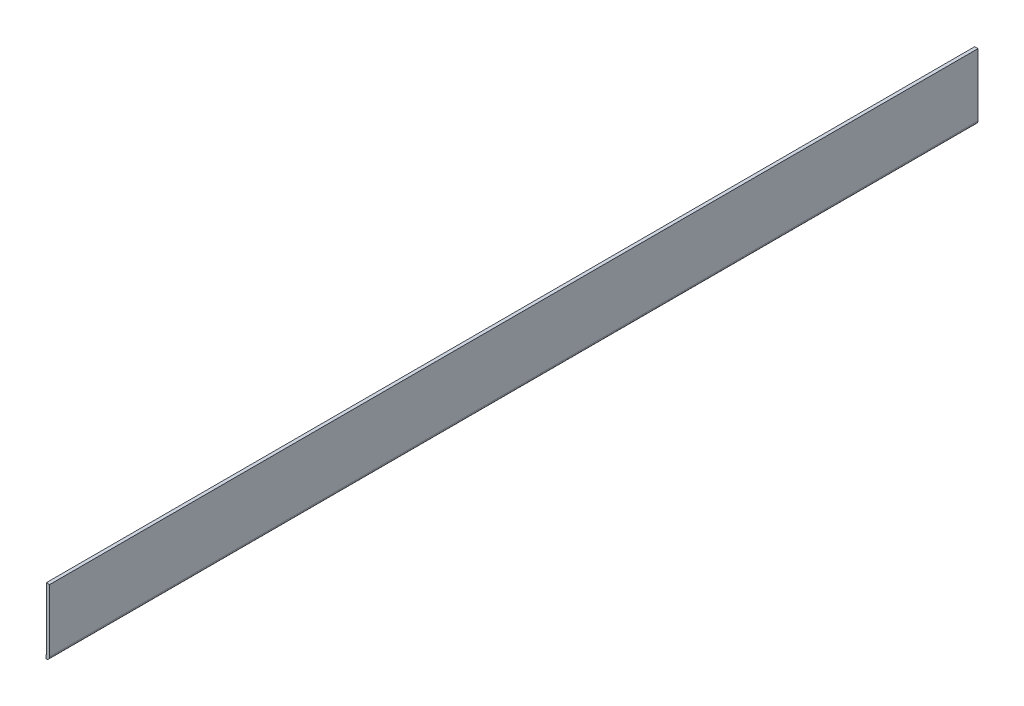
ISO-10303-21;
HEADER;
FILE_DESCRIPTION(('STEP AP214'),'2;1');
FILE_NAME('part.step','',(''),(''),'','','');
FILE_SCHEMA(('AUTOMOTIVE_DESIGN { 1 0 10303 214 1 1 1 1 }'));
ENDSEC;
DATA;
#1=APPLICATION_CONTEXT('core data for automotive mechanical design processes');
#2=APPLICATION_PROTOCOL_DEFINITION('international standard','automotive_design',2000,#1);
#3=PRODUCT_CONTEXT('',#1,'mechanical');
#4=PRODUCT('Part','Part','',(#3));
#5=PRODUCT_RELATED_PRODUCT_CATEGORY('part','',(#4));
#6=PRODUCT_DEFINITION_FORMATION('','',#4);
#7=PRODUCT_DEFINITION_CONTEXT('part definition',#1,'design');
#8=PRODUCT_DEFINITION('design','',#6,#7);
#9=PRODUCT_DEFINITION_SHAPE('','',#8);
#10=(LENGTH_UNIT() NAMED_UNIT(*) SI_UNIT(.MILLI.,.METRE.));
#11=(NAMED_UNIT(*) PLANE_ANGLE_UNIT() SI_UNIT($,.RADIAN.));
#12=(NAMED_UNIT(*) SI_UNIT($,.STERADIAN.) SOLID_ANGLE_UNIT());
#13=UNCERTAINTY_MEASURE_WITH_UNIT(LENGTH_MEASURE(1.E-05),#10,'distance_accuracy_value','');
#14=(GEOMETRIC_REPRESENTATION_CONTEXT(3) GLOBAL_UNCERTAINTY_ASSIGNED_CONTEXT((#13)) GLOBAL_UNIT_ASSIGNED_CONTEXT((#10,
#11,#12)) REPRESENTATION_CONTEXT('',''));
#15=CARTESIAN_POINT('',(0.,0.,0.));
#16=DIRECTION('',(0.,0.,1.));
#17=DIRECTION('',(1.,0.,0.));
#18=AXIS2_PLACEMENT_3D('',#15,#16,#17);
#19=CARTESIAN_POINT('',(-358.788602010546,1.05,281.));
#20=DIRECTION('',(1.,0.,0.));
#21=DIRECTION('',(0.,0.,-1.));
#22=AXIS2_PLACEMENT_3D('',#19,#20,#21);
#23=PLANE('',#22);
#24=DIRECTION('',(0.,0.,-1.));
#25=VECTOR('',#24,1.);
#26=CARTESIAN_POINT('',(-358.788602010546,0.00119115182985402,-281.));
#27=LINE('',#26,#25);
#28=CARTESIAN_POINT('',(-358.788602010546,0.00119115182985381,-281.));
#29=VERTEX_POINT('',#28);
#30=CARTESIAN_POINT('',(-358.788602010546,0.00119115182985402,0.));
#31=VERTEX_POINT('',#30);
#32=EDGE_CURVE('E46',#29,#31,#27,.F.);
#33=ORIENTED_EDGE('',*,*,#32,.T.);
#34=DIRECTION('',(0.,-1.,0.));
#35=VECTOR('',#34,1.);
#36=CARTESIAN_POINT('',(-358.788602010546,1.05,0.));
#37=LINE('',#36,#35);
#38=CARTESIAN_POINT('',(-358.788602010546,1.05,0.));
#39=VERTEX_POINT('',#38);
#40=EDGE_CURVE('E129',#39,#31,#37,.T.);
#41=ORIENTED_EDGE('',*,*,#40,.F.);
#42=DIRECTION('',(0.,0.,-1.));
#43=VECTOR('',#42,1.);
#44=CARTESIAN_POINT('',(-358.788602010546,1.05,-281.));
#45=LINE('',#44,#43);
#46=CARTESIAN_POINT('',(-358.788602010546,1.05,-281.));
#47=VERTEX_POINT('',#46);
#48=EDGE_CURVE('E61',#47,#39,#45,.F.);
#49=ORIENTED_EDGE('',*,*,#48,.F.);
#50=DIRECTION('',(0.,1.,0.));
#51=VECTOR('',#50,1.);
#52=CARTESIAN_POINT('',(-358.788602010546,1.05,-281.));
#53=LINE('',#52,#51);
#54=EDGE_CURVE('E54',#47,#29,#53,.F.);
#55=ORIENTED_EDGE('',*,*,#54,.T.);
#56=EDGE_LOOP('',(#33,#41,#49,#55));
#57=FACE_BOUND('',#56,.T.);
#58=ADVANCED_FACE('F37',(#57),#23,.F.);
#59=CARTESIAN_POINT('',(0.,0.,0.));
#60=DIRECTION('',(0.,0.,1.));
#61=DIRECTION('',(1.,0.,0.));
#62=AXIS2_PLACEMENT_3D('',#59,#60,#61);
#63=PLANE('',#62);
#64=CARTESIAN_POINT('',(-358.738602010546,1.05,0.));
#65=DIRECTION('',(0.,0.,1.));
#66=DIRECTION('',(1.,0.,0.));
#67=AXIS2_PLACEMENT_3D('',#64,#65,#66);
#68=CIRCLE('',#67,1.04999999999999);
#69=CARTESIAN_POINT('',(-357.688602010546,1.05,0.));
#70=VERTEX_POINT('',#69);
#71=EDGE_CURVE('E41',#70,#31,#68,.F.);
#72=ORIENTED_EDGE('',*,*,#71,.F.);
#73=DIRECTION('',(0.,-1.,0.));
#74=VECTOR('',#73,1.);
#75=CARTESIAN_POINT('',(-357.688602010546,10.525,0.));
#76=LINE('',#75,#74);
#77=CARTESIAN_POINT('',(-357.688602010546,20.,0.));
#78=VERTEX_POINT('',#77);
#79=EDGE_CURVE('E138',#78,#70,#76,.T.);
#80=ORIENTED_EDGE('',*,*,#79,.F.);
#81=DIRECTION('',(-1.,0.,0.));
#82=VECTOR('',#81,1.);
#83=CARTESIAN_POINT('',(-357.688602010546,20.,0.));
#84=LINE('',#83,#82);
#85=CARTESIAN_POINT('',(-358.688602010546,20.,0.));
#86=VERTEX_POINT('',#85);
#87=EDGE_CURVE('E101',#86,#78,#84,.F.);
#88=ORIENTED_EDGE('',*,*,#87,.F.);
#89=DIRECTION('',(0.,-1.,0.));
#90=VECTOR('',#89,1.);
#91=CARTESIAN_POINT('',(-358.688602010546,10.525,0.));
#92=LINE('',#91,#90);
#93=CARTESIAN_POINT('',(-358.688602010546,1.05,0.));
#94=VERTEX_POINT('',#93);
#95=EDGE_CURVE('E133',#86,#94,#92,.T.);
#96=ORIENTED_EDGE('',*,*,#95,.T.);
#97=CARTESIAN_POINT('',(-358.738602010546,1.05,0.));
#98=DIRECTION('',(0.,0.,1.));
#99=DIRECTION('',(1.,0.,0.));
#100=AXIS2_PLACEMENT_3D('',#97,#98,#99);
#101=CIRCLE('',#100,0.0499999999999945);
#102=EDGE_CURVE('E11',#94,#39,#101,.F.);
#103=ORIENTED_EDGE('',*,*,#102,.T.);
#104=ORIENTED_EDGE('',*,*,#40,.T.);
#105=EDGE_LOOP('',(#72,#80,#88,#96,#103,#104));
#106=FACE_BOUND('',#105,.T.);
#107=ADVANCED_FACE('F39',(#106),#63,.T.);
#108=CARTESIAN_POINT('',(-357.688602010546,20.,0.));
#109=DIRECTION('',(0.,-1.,0.));
#110=DIRECTION('',(0.,0.,-1.));
#111=AXIS2_PLACEMENT_3D('',#108,#109,#110);
#112=PLANE('',#111);
#113=DIRECTION('',(0.,0.,-1.));
#114=VECTOR('',#113,1.);
#115=CARTESIAN_POINT('',(-358.688602010546,20.,0.));
#116=LINE('',#115,#114);
#117=CARTESIAN_POINT('',(-358.688602010546,20.,-281.));
#118=VERTEX_POINT('',#117);
#119=EDGE_CURVE('E119',#86,#118,#116,.T.);
#120=ORIENTED_EDGE('',*,*,#119,.F.);
#121=ORIENTED_EDGE('',*,*,#87,.T.);
#122=DIRECTION('',(0.,0.,-1.));
#123=VECTOR('',#122,1.);
#124=CARTESIAN_POINT('',(-357.688602010546,20.,0.));
#125=LINE('',#124,#123);
#126=CARTESIAN_POINT('',(-357.688602010546,20.,-281.));
#127=VERTEX_POINT('',#126);
#128=EDGE_CURVE('E95',#78,#127,#125,.T.);
#129=ORIENTED_EDGE('',*,*,#128,.T.);
#130=DIRECTION('',(1.,0.,0.));
#131=VECTOR('',#130,1.);
#132=CARTESIAN_POINT('',(-357.688602010546,20.,-281.));
#133=LINE('',#132,#131);
#134=EDGE_CURVE('E98',#118,#127,#133,.T.);
#135=ORIENTED_EDGE('',*,*,#134,.F.);
#136=EDGE_LOOP('',(#120,#121,#129,#135));
#137=FACE_BOUND('',#136,.T.);
#138=ADVANCED_FACE('F97',(#137),#112,.F.);
#139=CARTESIAN_POINT('',(-357.688602010546,10.525,-281.));
#140=DIRECTION('',(0.,0.,1.));
#141=DIRECTION('',(0.,-1.,0.));
#142=AXIS2_PLACEMENT_3D('',#139,#140,#141);
#143=PLANE('',#142);
#144=DIRECTION('',(1.,0.,0.));
#145=VECTOR('',#144,1.);
#146=CARTESIAN_POINT('',(-357.688602010546,1.05,-281.));
#147=LINE('',#146,#145);
#148=CARTESIAN_POINT('',(-358.688602010546,1.05,-281.));
#149=VERTEX_POINT('',#148);
#150=CARTESIAN_POINT('',(-357.688602010546,1.05,-281.));
#151=VERTEX_POINT('',#150);
#152=EDGE_CURVE('E113',#149,#151,#147,.T.);
#153=ORIENTED_EDGE('',*,*,#152,.F.);
#154=DIRECTION('',(0.,1.,0.));
#155=VECTOR('',#154,1.);
#156=CARTESIAN_POINT('',(-358.688602010546,10.525,-281.));
#157=LINE('',#156,#155);
#158=EDGE_CURVE('E112',#118,#149,#157,.F.);
#159=ORIENTED_EDGE('',*,*,#158,.F.);
#160=ORIENTED_EDGE('',*,*,#134,.T.);
#161=DIRECTION('',(0.,-1.,0.));
#162=VECTOR('',#161,1.);
#163=CARTESIAN_POINT('',(-357.688602010546,10.525,-281.));
#164=LINE('',#163,#162);
#165=EDGE_CURVE('E105',#127,#151,#164,.T.);
#166=ORIENTED_EDGE('',*,*,#165,.T.);
#167=EDGE_LOOP('',(#153,#159,#160,#166));
#168=FACE_BOUND('',#167,.T.);
#169=ADVANCED_FACE('F109',(#168),#143,.F.);
#170=CARTESIAN_POINT('',(-358.738602010546,1.05,-281.));
#171=DIRECTION('',(0.,0.,1.));
#172=DIRECTION('',(1.,0.,0.));
#173=AXIS2_PLACEMENT_3D('',#170,#171,#172);
#174=PLANE('',#173);
#175=ORIENTED_EDGE('',*,*,#54,.F.);
#176=CARTESIAN_POINT('',(-358.738602010546,1.05,-281.));
#177=DIRECTION('',(0.,0.,-1.));
#178=DIRECTION('',(-1.,0.,0.));
#179=AXIS2_PLACEMENT_3D('',#176,#177,#178);
#180=CIRCLE('',#179,0.0499999999999945);
#181=EDGE_CURVE('E131',#149,#47,#180,.T.);
#182=ORIENTED_EDGE('',*,*,#181,.F.);
#183=ORIENTED_EDGE('',*,*,#152,.T.);
#184=CARTESIAN_POINT('',(-358.738602010546,1.05,-281.));
#185=DIRECTION('',(0.,0.,-1.));
#186=DIRECTION('',(-1.,0.,0.));
#187=AXIS2_PLACEMENT_3D('',#184,#185,#186);
#188=CIRCLE('',#187,1.04999999999999);
#189=EDGE_CURVE('E126',#151,#29,#188,.T.);
#190=ORIENTED_EDGE('',*,*,#189,.T.);
#191=EDGE_LOOP('',(#175,#182,#183,#190));
#192=FACE_BOUND('',#191,.T.);
#193=ADVANCED_FACE('F150',(#192),#174,.F.);
#194=CARTESIAN_POINT('',(-358.688602010546,10.525,0.));
#195=DIRECTION('',(1.,0.,0.));
#196=DIRECTION('',(0.,0.,-1.));
#197=AXIS2_PLACEMENT_3D('',#194,#195,#196);
#198=PLANE('',#197);
#199=ORIENTED_EDGE('',*,*,#95,.F.);
#200=ORIENTED_EDGE('',*,*,#119,.T.);
#201=ORIENTED_EDGE('',*,*,#158,.T.);
#202=DIRECTION('',(0.,0.,-1.));
#203=VECTOR('',#202,1.);
#204=CARTESIAN_POINT('',(-358.688602010546,1.05,0.));
#205=LINE('',#204,#203);
#206=EDGE_CURVE('E125',#149,#94,#205,.F.);
#207=ORIENTED_EDGE('',*,*,#206,.T.);
#208=EDGE_LOOP('',(#199,#200,#201,#207));
#209=FACE_BOUND('',#208,.T.);
#210=ADVANCED_FACE('F153',(#209),#198,.F.);
#211=CARTESIAN_POINT('',(-358.738602010546,1.05,-281.));
#212=DIRECTION('',(0.,0.,-1.));
#213=DIRECTION('',(1.,0.,0.));
#214=AXIS2_PLACEMENT_3D('',#211,#212,#213);
#215=CYLINDRICAL_SURFACE('',#214,0.0499999999999945);
#216=ORIENTED_EDGE('',*,*,#102,.F.);
#217=ORIENTED_EDGE('',*,*,#206,.F.);
#218=ORIENTED_EDGE('',*,*,#181,.T.);
#219=ORIENTED_EDGE('',*,*,#48,.T.);
#220=EDGE_LOOP('',(#216,#217,#218,#219));
#221=FACE_BOUND('',#220,.T.);
#222=ADVANCED_FACE('F148',(#221),#215,.F.);
#223=CARTESIAN_POINT('',(-357.688602010546,10.525,0.));
#224=DIRECTION('',(1.,0.,0.));
#225=DIRECTION('',(0.,0.,-1.));
#226=AXIS2_PLACEMENT_3D('',#223,#224,#225);
#227=PLANE('',#226);
#228=ORIENTED_EDGE('',*,*,#128,.F.);
#229=ORIENTED_EDGE('',*,*,#79,.T.);
#230=DIRECTION('',(0.,0.,1.));
#231=VECTOR('',#230,1.);
#232=CARTESIAN_POINT('',(-357.688602010546,1.05,0.));
#233=LINE('',#232,#231);
#234=EDGE_CURVE('E117',#151,#70,#233,.T.);
#235=ORIENTED_EDGE('',*,*,#234,.F.);
#236=ORIENTED_EDGE('',*,*,#165,.F.);
#237=EDGE_LOOP('',(#228,#229,#235,#236));
#238=FACE_BOUND('',#237,.T.);
#239=ADVANCED_FACE('F115',(#238),#227,.T.);
#240=CARTESIAN_POINT('',(-358.738602010546,1.05,-281.));
#241=DIRECTION('',(0.,0.,-1.));
#242=DIRECTION('',(1.,0.,0.));
#243=AXIS2_PLACEMENT_3D('',#240,#241,#242);
#244=CYLINDRICAL_SURFACE('',#243,1.04999999999999);
#245=ORIENTED_EDGE('',*,*,#234,.T.);
#246=ORIENTED_EDGE('',*,*,#71,.T.);
#247=ORIENTED_EDGE('',*,*,#32,.F.);
#248=ORIENTED_EDGE('',*,*,#189,.F.);
#249=EDGE_LOOP('',(#245,#246,#247,#248));
#250=FACE_BOUND('',#249,.T.);
#251=ADVANCED_FACE('F142',(#250),#244,.T.);
#252=CLOSED_SHELL('',(#58,#107,#138,#169,#193,#210,#222,#239,#251));
#253=MANIFOLD_SOLID_BREP('B2',#252);
#254=ADVANCED_BREP_SHAPE_REPRESENTATION('',(#18,#253),#14);
#255=SHAPE_DEFINITION_REPRESENTATION(#9,#254);
ENDSEC;
END-ISO-10303-21;
